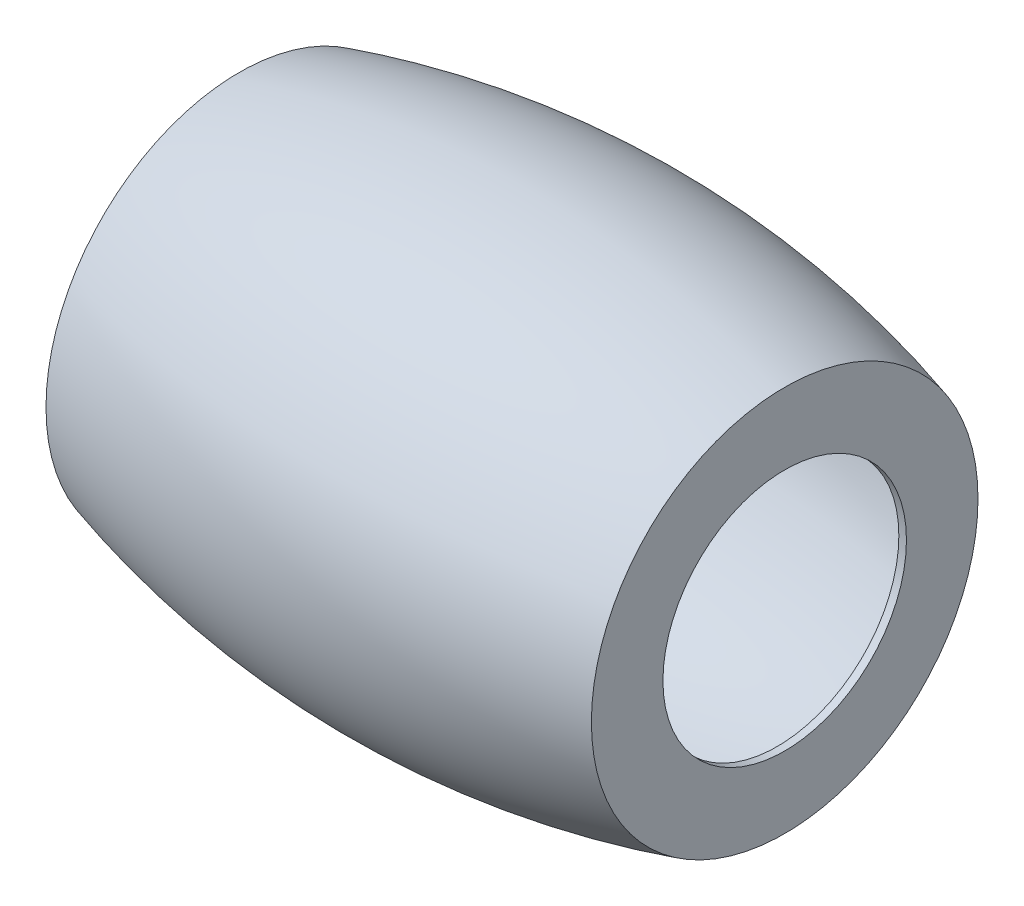
ISO-10303-21;
HEADER;
FILE_DESCRIPTION(('STEP AP214'),'2;1');
FILE_NAME('part.step','',(''),(''),'','','');
FILE_SCHEMA(('AUTOMOTIVE_DESIGN { 1 0 10303 214 1 1 1 1 }'));
ENDSEC;
DATA;
#1=APPLICATION_CONTEXT('core data for automotive mechanical design processes');
#2=APPLICATION_PROTOCOL_DEFINITION('international standard','automotive_design',2000,#1);
#3=PRODUCT_CONTEXT('',#1,'mechanical');
#4=PRODUCT('Part','Part','',(#3));
#5=PRODUCT_RELATED_PRODUCT_CATEGORY('part','',(#4));
#6=PRODUCT_DEFINITION_FORMATION('','',#4);
#7=PRODUCT_DEFINITION_CONTEXT('part definition',#1,'design');
#8=PRODUCT_DEFINITION('design','',#6,#7);
#9=PRODUCT_DEFINITION_SHAPE('','',#8);
#10=(LENGTH_UNIT() NAMED_UNIT(*) SI_UNIT(.MILLI.,.METRE.));
#11=(NAMED_UNIT(*) PLANE_ANGLE_UNIT() SI_UNIT($,.RADIAN.));
#12=(NAMED_UNIT(*) SI_UNIT($,.STERADIAN.) SOLID_ANGLE_UNIT());
#13=UNCERTAINTY_MEASURE_WITH_UNIT(LENGTH_MEASURE(1.E-05),#10,'distance_accuracy_value','');
#14=(GEOMETRIC_REPRESENTATION_CONTEXT(3) GLOBAL_UNCERTAINTY_ASSIGNED_CONTEXT((#13)) GLOBAL_UNIT_ASSIGNED_CONTEXT((#10,
#11,#12)) REPRESENTATION_CONTEXT('',''));
#15=CARTESIAN_POINT('',(0.,0.,0.));
#16=DIRECTION('',(0.,0.,1.));
#17=DIRECTION('',(1.,0.,0.));
#18=AXIS2_PLACEMENT_3D('',#15,#16,#17);
#19=CARTESIAN_POINT('',(0.,0.,0.));
#20=DIRECTION('',(1.,0.,0.));
#21=DIRECTION('',(0.,0.,-1.));
#22=AXIS2_PLACEMENT_3D('',#19,#20,#21);
#23=DEGENERATE_TOROIDAL_SURFACE('',#22,49.7820102359908,65.,.F.);
#24=CARTESIAN_POINT('',(-17.9164281281048,0.,0.));
#25=DIRECTION('',(1.,0.,0.));
#26=DIRECTION('',(0.,0.,-1.));
#27=AXIS2_PLACEMENT_3D('',#24,#25,#26);
#28=CIRCLE('',#27,12.7);
#29=CARTESIAN_POINT('',(-17.9164281281048,0.,-12.7));
#30=VERTEX_POINT('',#29);
#31=EDGE_CURVE('E10',#30,#30,#28,.T.);
#32=ORIENTED_EDGE('',*,*,#31,.T.);
#33=EDGE_LOOP('',(#32));
#34=FACE_BOUND('',#33,.T.);
#35=CARTESIAN_POINT('',(17.9164281281048,0.,0.));
#36=DIRECTION('',(1.,0.,0.));
#37=DIRECTION('',(0.,0.,-1.));
#38=AXIS2_PLACEMENT_3D('',#35,#36,#37);
#39=CIRCLE('',#38,12.7);
#40=CARTESIAN_POINT('',(17.9164281281048,0.,-12.7));
#41=VERTEX_POINT('',#40);
#42=EDGE_CURVE('E62',#41,#41,#39,.T.);
#43=ORIENTED_EDGE('',*,*,#42,.F.);
#44=EDGE_LOOP('',(#43));
#45=FACE_BOUND('',#44,.T.);
#46=ADVANCED_FACE('F34',(#34,#45),#23,.F.);
#47=CARTESIAN_POINT('',(-17.9164281281048,7.99999999999999,0.));
#48=DIRECTION('',(-1.,0.,0.));
#49=DIRECTION('',(0.,0.,1.));
#50=AXIS2_PLACEMENT_3D('',#47,#48,#49);
#51=PLANE('',#50);
#52=CARTESIAN_POINT('',(-17.9164281281048,0.,0.));
#53=DIRECTION('',(1.,0.,0.));
#54=DIRECTION('',(0.,0.,-1.));
#55=AXIS2_PLACEMENT_3D('',#52,#53,#54);
#56=CIRCLE('',#55,7.99999999999999);
#57=CARTESIAN_POINT('',(-17.9164281281048,0.,-7.99999999999999));
#58=VERTEX_POINT('',#57);
#59=EDGE_CURVE('E40',#58,#58,#56,.T.);
#60=ORIENTED_EDGE('',*,*,#59,.T.);
#61=EDGE_LOOP('',(#60));
#62=FACE_BOUND('',#61,.T.);
#63=ORIENTED_EDGE('',*,*,#31,.F.);
#64=EDGE_LOOP('',(#63));
#65=FACE_BOUND('',#64,.T.);
#66=ADVANCED_FACE('F70',(#62,#65),#51,.T.);
#67=CARTESIAN_POINT('',(17.9164281281048,0.,0.));
#68=DIRECTION('',(1.,0.,0.));
#69=DIRECTION('',(0.,0.,-1.));
#70=AXIS2_PLACEMENT_3D('',#67,#68,#69);
#71=CYLINDRICAL_SURFACE('',#70,7.99999999999999);
#72=CARTESIAN_POINT('',(-17.4164281281047,0.,0.));
#73=DIRECTION('',(1.,0.,0.));
#74=DIRECTION('',(0.,0.,-1.));
#75=AXIS2_PLACEMENT_3D('',#72,#73,#74);
#76=CIRCLE('',#75,7.99999999999999);
#77=CARTESIAN_POINT('',(-17.4164281281047,0.,-7.99999999999999));
#78=VERTEX_POINT('',#77);
#79=EDGE_CURVE('E44',#78,#78,#76,.T.);
#80=ORIENTED_EDGE('',*,*,#79,.T.);
#81=EDGE_LOOP('',(#80));
#82=FACE_BOUND('',#81,.T.);
#83=ORIENTED_EDGE('',*,*,#59,.F.);
#84=EDGE_LOOP('',(#83));
#85=FACE_BOUND('',#84,.T.);
#86=ADVANCED_FACE('F74',(#82,#85),#71,.F.);
#87=CARTESIAN_POINT('',(-17.4164281281047,7.99999999999999,0.));
#88=DIRECTION('',(1.,0.,0.));
#89=DIRECTION('',(0.,0.,-1.));
#90=AXIS2_PLACEMENT_3D('',#87,#88,#89);
#91=PLANE('',#90);
#92=CARTESIAN_POINT('',(-17.4164281281047,0.,0.));
#93=DIRECTION('',(1.,0.,0.));
#94=DIRECTION('',(0.,0.,-1.));
#95=AXIS2_PLACEMENT_3D('',#92,#93,#94);
#96=CIRCLE('',#95,12.322080058116);
#97=CARTESIAN_POINT('',(-17.4164281281047,0.,-12.322080058116));
#98=VERTEX_POINT('',#97);
#99=EDGE_CURVE('E48',#98,#98,#96,.T.);
#100=ORIENTED_EDGE('',*,*,#99,.T.);
#101=EDGE_LOOP('',(#100));
#102=FACE_BOUND('',#101,.T.);
#103=ORIENTED_EDGE('',*,*,#79,.F.);
#104=EDGE_LOOP('',(#103));
#105=FACE_BOUND('',#104,.T.);
#106=ADVANCED_FACE('F78',(#102,#105),#91,.T.);
#107=CARTESIAN_POINT('',(0.,0.,0.));
#108=DIRECTION('',(1.,0.,0.));
#109=DIRECTION('',(0.,0.,-1.));
#110=AXIS2_PLACEMENT_3D('',#107,#108,#109);
#111=DEGENERATE_TOROIDAL_SURFACE('',#110,49.7820102359908,64.5,.F.);
#112=CARTESIAN_POINT('',(17.4164281281047,0.,0.));
#113=DIRECTION('',(1.,0.,0.));
#114=DIRECTION('',(0.,0.,-1.));
#115=AXIS2_PLACEMENT_3D('',#112,#113,#114);
#116=CIRCLE('',#115,12.322080058116);
#117=CARTESIAN_POINT('',(17.4164281281047,0.,-12.322080058116));
#118=VERTEX_POINT('',#117);
#119=EDGE_CURVE('E53',#118,#118,#116,.T.);
#120=ORIENTED_EDGE('',*,*,#119,.T.);
#121=EDGE_LOOP('',(#120));
#122=FACE_BOUND('',#121,.T.);
#123=ORIENTED_EDGE('',*,*,#99,.F.);
#124=EDGE_LOOP('',(#123));
#125=FACE_BOUND('',#124,.T.);
#126=ADVANCED_FACE('F85',(#122,#125),#111,.T.);
#127=CARTESIAN_POINT('',(17.4164281281047,7.99999999999999,0.));
#128=DIRECTION('',(-1.,0.,0.));
#129=DIRECTION('',(0.,0.,1.));
#130=AXIS2_PLACEMENT_3D('',#127,#128,#129);
#131=PLANE('',#130);
#132=CARTESIAN_POINT('',(17.4164281281047,0.,0.));
#133=DIRECTION('',(1.,0.,0.));
#134=DIRECTION('',(0.,0.,-1.));
#135=AXIS2_PLACEMENT_3D('',#132,#133,#134);
#136=CIRCLE('',#135,7.99999999999999);
#137=CARTESIAN_POINT('',(17.4164281281047,0.,-7.99999999999999));
#138=VERTEX_POINT('',#137);
#139=EDGE_CURVE('E56',#138,#138,#136,.T.);
#140=ORIENTED_EDGE('',*,*,#139,.T.);
#141=EDGE_LOOP('',(#140));
#142=FACE_BOUND('',#141,.T.);
#143=ORIENTED_EDGE('',*,*,#119,.F.);
#144=EDGE_LOOP('',(#143));
#145=FACE_BOUND('',#144,.T.);
#146=ADVANCED_FACE('F89',(#142,#145),#131,.T.);
#147=CARTESIAN_POINT('',(17.9164281281048,0.,0.));
#148=DIRECTION('',(1.,0.,0.));
#149=DIRECTION('',(0.,0.,-1.));
#150=AXIS2_PLACEMENT_3D('',#147,#148,#149);
#151=CYLINDRICAL_SURFACE('',#150,7.99999999999999);
#152=CARTESIAN_POINT('',(17.9164281281048,0.,0.));
#153=DIRECTION('',(1.,0.,0.));
#154=DIRECTION('',(0.,0.,-1.));
#155=AXIS2_PLACEMENT_3D('',#152,#153,#154);
#156=CIRCLE('',#155,7.99999999999999);
#157=CARTESIAN_POINT('',(17.9164281281048,0.,-7.99999999999999));
#158=VERTEX_POINT('',#157);
#159=EDGE_CURVE('E59',#158,#158,#156,.T.);
#160=ORIENTED_EDGE('',*,*,#159,.T.);
#161=EDGE_LOOP('',(#160));
#162=FACE_BOUND('',#161,.T.);
#163=ORIENTED_EDGE('',*,*,#139,.F.);
#164=EDGE_LOOP('',(#163));
#165=FACE_BOUND('',#164,.T.);
#166=ADVANCED_FACE('F93',(#162,#165),#151,.F.);
#167=CARTESIAN_POINT('',(17.9164281281048,7.99999999999999,0.));
#168=DIRECTION('',(1.,0.,0.));
#169=DIRECTION('',(0.,0.,-1.));
#170=AXIS2_PLACEMENT_3D('',#167,#168,#169);
#171=PLANE('',#170);
#172=ORIENTED_EDGE('',*,*,#42,.T.);
#173=EDGE_LOOP('',(#172));
#174=FACE_BOUND('',#173,.T.);
#175=ORIENTED_EDGE('',*,*,#159,.F.);
#176=EDGE_LOOP('',(#175));
#177=FACE_BOUND('',#176,.T.);
#178=ADVANCED_FACE('F66',(#174,#177),#171,.T.);
#179=CLOSED_SHELL('',(#46,#66,#86,#106,#126,#146,#166,#178));
#180=MANIFOLD_SOLID_BREP('B2',#179);
#181=ADVANCED_BREP_SHAPE_REPRESENTATION('',(#18,#180),#14);
#182=SHAPE_DEFINITION_REPRESENTATION(#9,#181);
ENDSEC;
END-ISO-10303-21;
